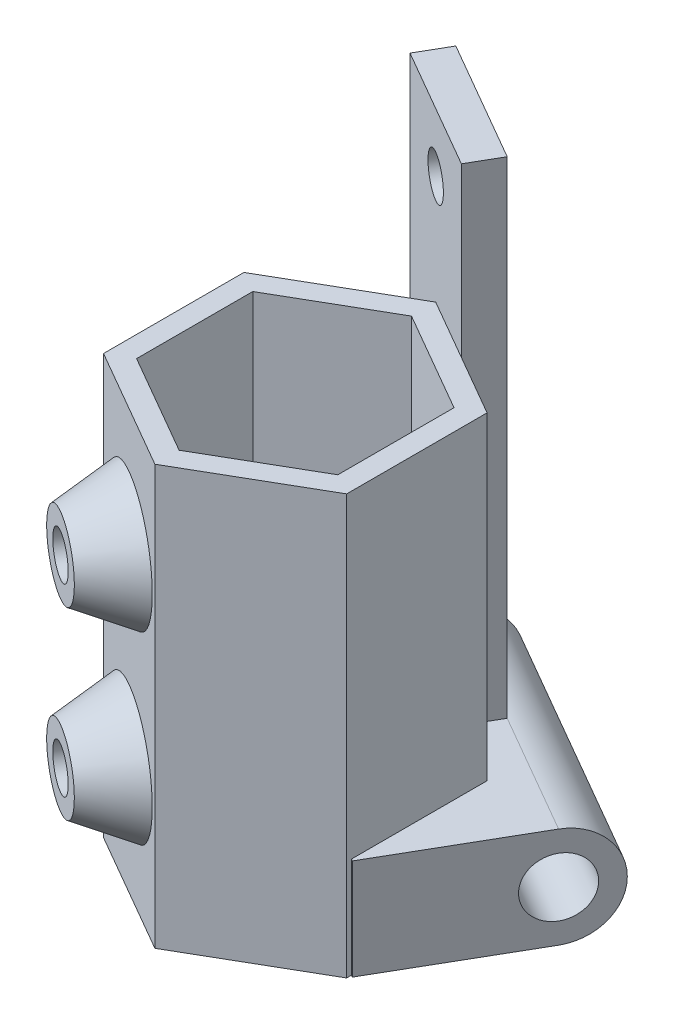
ISO-10303-21;
HEADER;
FILE_DESCRIPTION(('STEP AP214'),'2;1');
FILE_NAME('part.step','',(''),(''),'','','');
FILE_SCHEMA(('AUTOMOTIVE_DESIGN { 1 0 10303 214 1 1 1 1 }'));
ENDSEC;
DATA;
#1=APPLICATION_CONTEXT('core data for automotive mechanical design processes');
#2=APPLICATION_PROTOCOL_DEFINITION('international standard','automotive_design',2000,#1);
#3=PRODUCT_CONTEXT('',#1,'mechanical');
#4=PRODUCT('Part','Part','',(#3));
#5=PRODUCT_RELATED_PRODUCT_CATEGORY('part','',(#4));
#6=PRODUCT_DEFINITION_FORMATION('','',#4);
#7=PRODUCT_DEFINITION_CONTEXT('part definition',#1,'design');
#8=PRODUCT_DEFINITION('design','',#6,#7);
#9=PRODUCT_DEFINITION_SHAPE('','',#8);
#10=(LENGTH_UNIT() NAMED_UNIT(*) SI_UNIT(.MILLI.,.METRE.));
#11=(NAMED_UNIT(*) PLANE_ANGLE_UNIT() SI_UNIT($,.RADIAN.));
#12=(NAMED_UNIT(*) SI_UNIT($,.STERADIAN.) SOLID_ANGLE_UNIT());
#13=UNCERTAINTY_MEASURE_WITH_UNIT(LENGTH_MEASURE(1.E-05),#10,'distance_accuracy_value','');
#14=(GEOMETRIC_REPRESENTATION_CONTEXT(3) GLOBAL_UNCERTAINTY_ASSIGNED_CONTEXT((#13)) GLOBAL_UNIT_ASSIGNED_CONTEXT((#10,
#11,#12)) REPRESENTATION_CONTEXT('',''));
#15=CARTESIAN_POINT('',(0.,0.,0.));
#16=DIRECTION('',(0.,0.,1.));
#17=DIRECTION('',(1.,0.,0.));
#18=AXIS2_PLACEMENT_3D('',#15,#16,#17);
#19=CARTESIAN_POINT('',(7.25,25.,-4.18578945162479));
#20=DIRECTION('',(-0.5,0.,0.866025403784439));
#21=DIRECTION('',(0.866025403784439,0.,0.5));
#22=AXIS2_PLACEMENT_3D('',#19,#20,#21);
#23=PLANE('',#22);
#24=DIRECTION('',(0.,-1.,0.));
#25=VECTOR('',#24,1.);
#26=CARTESIAN_POINT('',(3.625,35.,-6.27868417743718));
#27=LINE('',#26,#25);
#28=CARTESIAN_POINT('',(3.62500000000001,25.,-6.27868417743718));
#29=VERTEX_POINT('',#28);
#30=CARTESIAN_POINT('',(3.625,6.,-6.27868417743718));
#31=VERTEX_POINT('',#30);
#32=EDGE_CURVE('E52',#29,#31,#27,.T.);
#33=ORIENTED_EDGE('',*,*,#32,.F.);
#34=DIRECTION('',(-0.866025403784439,0.,-0.5));
#35=VECTOR('',#34,1.);
#36=CARTESIAN_POINT('',(7.25,25.,-4.18578945162479));
#37=LINE('',#36,#35);
#38=CARTESIAN_POINT('',(7.25,25.,-4.18578945162479));
#39=VERTEX_POINT('',#38);
#40=EDGE_CURVE('E340',#39,#29,#37,.T.);
#41=ORIENTED_EDGE('',*,*,#40,.F.);
#42=DIRECTION('',(0.,-1.,0.));
#43=VECTOR('',#42,1.);
#44=CARTESIAN_POINT('',(7.25,25.,-4.18578945162479));
#45=LINE('',#44,#43);
#46=CARTESIAN_POINT('',(7.25,6.,-4.18578945162479));
#47=VERTEX_POINT('',#46);
#48=EDGE_CURVE('E373',#39,#47,#45,.T.);
#49=ORIENTED_EDGE('',*,*,#48,.T.);
#50=DIRECTION('',(-0.866025403784439,0.,-0.5));
#51=VECTOR('',#50,1.);
#52=CARTESIAN_POINT('',(7.25,6.,-4.18578945162479));
#53=LINE('',#52,#51);
#54=EDGE_CURVE('E314',#47,#31,#53,.T.);
#55=ORIENTED_EDGE('',*,*,#54,.T.);
#56=EDGE_LOOP('',(#33,#41,#49,#55));
#57=FACE_BOUND('',#56,.T.);
#58=ADVANCED_FACE('F35',(#57),#23,.F.);
#59=CARTESIAN_POINT('',(7.375,6.,3.96928310067868));
#60=DIRECTION('',(0.,1.,0.));
#61=DIRECTION('',(0.,0.,1.));
#62=AXIS2_PLACEMENT_3D('',#59,#60,#61);
#63=PLANE('',#62);
#64=DIRECTION('',(-0.866025403784439,0.,0.5));
#65=VECTOR('',#64,1.);
#66=CARTESIAN_POINT('',(0.,6.,-8.37157890324957));
#67=LINE('',#66,#65);
#68=CARTESIAN_POINT('',(0.,6.,-8.37157890324957));
#69=VERTEX_POINT('',#68);
#70=CARTESIAN_POINT('',(-7.,6.,-4.33012701892219));
#71=VERTEX_POINT('',#70);
#72=EDGE_CURVE('E376',#69,#71,#67,.T.);
#73=ORIENTED_EDGE('',*,*,#72,.F.);
#74=DIRECTION('',(0.866025403784439,0.,0.5));
#75=VECTOR('',#74,1.);
#76=CARTESIAN_POINT('',(3.625,6.,-6.27868417743718));
#77=LINE('',#76,#75);
#78=CARTESIAN_POINT('',(-3.625,6.,-10.464473629062));
#79=VERTEX_POINT('',#78);
#80=EDGE_CURVE('E422',#79,#69,#77,.T.);
#81=ORIENTED_EDGE('',*,*,#80,.F.);
#82=DIRECTION('',(0.5,0.,-0.866025403784439));
#83=VECTOR('',#82,1.);
#84=CARTESIAN_POINT('',(-7.125,6.,-4.4022958025709));
#85=LINE('',#84,#83);
#86=CARTESIAN_POINT('',(-7.125,6.,-4.4022958025709));
#87=VERTEX_POINT('',#86);
#88=EDGE_CURVE('E219',#87,#79,#85,.T.);
#89=ORIENTED_EDGE('',*,*,#88,.F.);
#90=DIRECTION('',(0.866025403784439,0.,0.5));
#91=VECTOR('',#90,1.);
#92=CARTESIAN_POINT('',(7.375,6.,3.96928310067868));
#93=LINE('',#92,#91);
#94=EDGE_CURVE('E295',#87,#71,#93,.T.);
#95=ORIENTED_EDGE('',*,*,#94,.T.);
#96=EDGE_LOOP('',(#73,#81,#89,#95));
#97=FACE_BOUND('',#96,.T.);
#98=ADVANCED_FACE('F421',(#97),#63,.T.);
#99=DIRECTION('',(0.866025403784439,0.,0.5));
#100=VECTOR('',#99,1.);
#101=CARTESIAN_POINT('',(11.875,6.,-3.82494553338127));
#102=LINE('',#101,#100);
#103=CARTESIAN_POINT('',(11.875,6.,-3.82494553338127));
#104=VERTEX_POINT('',#103);
#105=CARTESIAN_POINT('',(4.625,6.,-8.01073498500606));
#106=VERTEX_POINT('',#105);
#107=EDGE_CURVE('E11',#104,#106,#102,.F.);
#108=ORIENTED_EDGE('',*,*,#107,.T.);
#109=DIRECTION('',(0.500000000000001,0.,-0.866025403784438));
#110=VECTOR('',#109,1.);
#111=CARTESIAN_POINT('',(4.625,6.,-8.01073498500605));
#112=LINE('',#111,#110);
#113=EDGE_CURVE('E59',#31,#106,#112,.T.);
#114=ORIENTED_EDGE('',*,*,#113,.F.);
#115=ORIENTED_EDGE('',*,*,#54,.F.);
#116=DIRECTION('',(0.,0.,-1.));
#117=VECTOR('',#116,1.);
#118=CARTESIAN_POINT('',(7.25,6.,4.18578945162479));
#119=LINE('',#118,#117);
#120=CARTESIAN_POINT('',(7.25,6.,3.89711431702998));
#121=VERTEX_POINT('',#120);
#122=EDGE_CURVE('E316',#121,#47,#119,.T.);
#123=ORIENTED_EDGE('',*,*,#122,.F.);
#124=CARTESIAN_POINT('',(7.375,6.,3.96928310067868));
#125=VERTEX_POINT('',#124);
#126=EDGE_CURVE('E294',#121,#125,#93,.T.);
#127=ORIENTED_EDGE('',*,*,#126,.T.);
#128=DIRECTION('',(0.5,0.,-0.866025403784439));
#129=VECTOR('',#128,1.);
#130=CARTESIAN_POINT('',(7.375,6.,3.96928310067868));
#131=LINE('',#130,#129);
#132=EDGE_CURVE('E299',#125,#104,#131,.T.);
#133=ORIENTED_EDGE('',*,*,#132,.T.);
#134=EDGE_LOOP('',(#108,#114,#115,#123,#127,#133));
#135=FACE_BOUND('',#134,.T.);
#136=ADVANCED_FACE('F403',(#135),#63,.T.);
#137=CARTESIAN_POINT('',(7.25,25.,4.18578945162479));
#138=DIRECTION('',(-1.,0.,0.));
#139=DIRECTION('',(0.,0.,1.));
#140=AXIS2_PLACEMENT_3D('',#137,#138,#139);
#141=PLANE('',#140);
#142=DIRECTION('',(0.,-1.,0.));
#143=VECTOR('',#142,1.);
#144=CARTESIAN_POINT('',(7.25,25.,3.89711431702998));
#145=LINE('',#144,#143);
#146=CARTESIAN_POINT('',(7.25,0.,3.89711431702998));
#147=VERTEX_POINT('',#146);
#148=EDGE_CURVE('E311',#121,#147,#145,.T.);
#149=ORIENTED_EDGE('',*,*,#148,.F.);
#150=ORIENTED_EDGE('',*,*,#122,.T.);
#151=ORIENTED_EDGE('',*,*,#48,.F.);
#152=DIRECTION('',(0.,0.,-1.));
#153=VECTOR('',#152,1.);
#154=CARTESIAN_POINT('',(7.25,25.,4.18578945162479));
#155=LINE('',#154,#153);
#156=CARTESIAN_POINT('',(7.25,25.,4.18578945162479));
#157=VERTEX_POINT('',#156);
#158=EDGE_CURVE('E337',#157,#39,#155,.T.);
#159=ORIENTED_EDGE('',*,*,#158,.F.);
#160=DIRECTION('',(0.,-1.,0.));
#161=VECTOR('',#160,1.);
#162=CARTESIAN_POINT('',(7.25,25.,4.18578945162479));
#163=LINE('',#162,#161);
#164=CARTESIAN_POINT('',(7.25,0.,4.18578945162479));
#165=VERTEX_POINT('',#164);
#166=EDGE_CURVE('E351',#157,#165,#163,.T.);
#167=ORIENTED_EDGE('',*,*,#166,.T.);
#168=DIRECTION('',(0.,0.,-1.));
#169=VECTOR('',#168,1.);
#170=CARTESIAN_POINT('',(7.25,0.,4.18578945162479));
#171=LINE('',#170,#169);
#172=EDGE_CURVE('E336',#165,#147,#171,.T.);
#173=ORIENTED_EDGE('',*,*,#172,.T.);
#174=EDGE_LOOP('',(#149,#150,#151,#159,#167,#173));
#175=FACE_BOUND('',#174,.T.);
#176=ADVANCED_FACE('F467',(#175),#141,.F.);
#177=CARTESIAN_POINT('',(0.,25.,-8.37157890324957));
#178=DIRECTION('',(0.5,0.,0.866025403784439));
#179=DIRECTION('',(0.866025403784439,0.,-0.5));
#180=AXIS2_PLACEMENT_3D('',#177,#178,#179);
#181=PLANE('',#180);
#182=DIRECTION('',(0.,-1.,0.));
#183=VECTOR('',#182,1.);
#184=CARTESIAN_POINT('',(0.,25.,-8.37157890324957));
#185=LINE('',#184,#183);
#186=CARTESIAN_POINT('',(0.,25.,-8.37157890324957));
#187=VERTEX_POINT('',#186);
#188=EDGE_CURVE('E371',#187,#69,#185,.T.);
#189=ORIENTED_EDGE('',*,*,#188,.T.);
#190=ORIENTED_EDGE('',*,*,#72,.T.);
#191=DIRECTION('',(0.,1.,0.));
#192=VECTOR('',#191,1.);
#193=CARTESIAN_POINT('',(-7.00000000000001,25.,-4.33012701892219));
#194=LINE('',#193,#192);
#195=CARTESIAN_POINT('',(-7.,0.,-4.33012701892219));
#196=VERTEX_POINT('',#195);
#197=EDGE_CURVE('E302',#196,#71,#194,.T.);
#198=ORIENTED_EDGE('',*,*,#197,.F.);
#199=DIRECTION('',(-0.866025403784439,0.,0.5));
#200=VECTOR('',#199,1.);
#201=CARTESIAN_POINT('',(0.,0.,-8.37157890324957));
#202=LINE('',#201,#200);
#203=CARTESIAN_POINT('',(-7.25,0.,-4.18578945162479));
#204=VERTEX_POINT('',#203);
#205=EDGE_CURVE('E353',#196,#204,#202,.T.);
#206=ORIENTED_EDGE('',*,*,#205,.T.);
#207=DIRECTION('',(0.,-1.,0.));
#208=VECTOR('',#207,1.);
#209=CARTESIAN_POINT('',(-7.25,25.,-4.18578945162479));
#210=LINE('',#209,#208);
#211=CARTESIAN_POINT('',(-7.25,25.,-4.18578945162479));
#212=VERTEX_POINT('',#211);
#213=EDGE_CURVE('E368',#212,#204,#210,.T.);
#214=ORIENTED_EDGE('',*,*,#213,.F.);
#215=DIRECTION('',(-0.866025403784439,0.,0.5));
#216=VECTOR('',#215,1.);
#217=CARTESIAN_POINT('',(0.,25.,-8.37157890324957));
#218=LINE('',#217,#216);
#219=EDGE_CURVE('E343',#187,#212,#218,.T.);
#220=ORIENTED_EDGE('',*,*,#219,.F.);
#221=EDGE_LOOP('',(#189,#190,#198,#206,#214,#220));
#222=FACE_BOUND('',#221,.T.);
#223=ADVANCED_FACE('F465',(#222),#181,.F.);
#224=CARTESIAN_POINT('',(-7.25,25.,-4.18578945162479));
#225=DIRECTION('',(1.,0.,0.));
#226=DIRECTION('',(0.,0.,-1.));
#227=AXIS2_PLACEMENT_3D('',#224,#225,#226);
#228=PLANE('',#227);
#229=DIRECTION('',(0.,0.,1.));
#230=VECTOR('',#229,1.);
#231=CARTESIAN_POINT('',(-7.25,0.,-4.18578945162479));
#232=LINE('',#231,#230);
#233=CARTESIAN_POINT('',(-7.25,0.,4.18578945162479));
#234=VERTEX_POINT('',#233);
#235=EDGE_CURVE('E355',#204,#234,#232,.T.);
#236=ORIENTED_EDGE('',*,*,#235,.T.);
#237=DIRECTION('',(0.,-1.,0.));
#238=VECTOR('',#237,1.);
#239=CARTESIAN_POINT('',(-7.25,25.,4.18578945162479));
#240=LINE('',#239,#238);
#241=CARTESIAN_POINT('',(-7.25,25.,4.18578945162479));
#242=VERTEX_POINT('',#241);
#243=EDGE_CURVE('E365',#242,#234,#240,.T.);
#244=ORIENTED_EDGE('',*,*,#243,.F.);
#245=DIRECTION('',(0.,0.,1.));
#246=VECTOR('',#245,1.);
#247=CARTESIAN_POINT('',(-7.25,25.,-4.18578945162479));
#248=LINE('',#247,#246);
#249=EDGE_CURVE('E345',#212,#242,#248,.T.);
#250=ORIENTED_EDGE('',*,*,#249,.F.);
#251=ORIENTED_EDGE('',*,*,#213,.T.);
#252=EDGE_LOOP('',(#236,#244,#250,#251));
#253=FACE_BOUND('',#252,.T.);
#254=ADVANCED_FACE('F540',(#253),#228,.F.);
#255=CARTESIAN_POINT('',(-7.25,25.,4.18578945162479));
#256=DIRECTION('',(0.5,0.,-0.866025403784439));
#257=DIRECTION('',(-0.866025403784439,0.,-0.5));
#258=AXIS2_PLACEMENT_3D('',#255,#256,#257);
#259=PLANE('',#258);
#260=CARTESIAN_POINT('',(-3.625,7.,6.27868417743718));
#261=DIRECTION('',(-0.5,0.,0.866025403784439));
#262=DIRECTION('',(0.866025403784439,0.,0.5));
#263=AXIS2_PLACEMENT_3D('',#260,#261,#262);
#264=CIRCLE('',#263,3.75);
#265=CARTESIAN_POINT('',(-0.377404735808352,7.,8.15368417743718));
#266=VERTEX_POINT('',#265);
#267=EDGE_CURVE('E327',#266,#266,#264,.T.);
#268=ORIENTED_EDGE('',*,*,#267,.F.);
#269=EDGE_LOOP('',(#268));
#270=FACE_BOUND('',#269,.T.);
#271=CARTESIAN_POINT('',(-3.625,18.,6.27868417743718));
#272=DIRECTION('',(0.5,0.,-0.866025403784438));
#273=DIRECTION('',(-0.866025403784439,0.,-0.5));
#274=AXIS2_PLACEMENT_3D('',#271,#272,#273);
#275=CIRCLE('',#274,3.75);
#276=CARTESIAN_POINT('',(-6.87259526419165,18.,4.40368417743718));
#277=VERTEX_POINT('',#276);
#278=EDGE_CURVE('E333',#277,#277,#275,.T.);
#279=ORIENTED_EDGE('',*,*,#278,.T.);
#280=EDGE_LOOP('',(#279));
#281=FACE_BOUND('',#280,.T.);
#282=DIRECTION('',(0.866025403784439,0.,0.5));
#283=VECTOR('',#282,1.);
#284=CARTESIAN_POINT('',(-7.25,0.,4.18578945162479));
#285=LINE('',#284,#283);
#286=CARTESIAN_POINT('',(0.,0.,8.37157890324957));
#287=VERTEX_POINT('',#286);
#288=EDGE_CURVE('E357',#234,#287,#285,.T.);
#289=ORIENTED_EDGE('',*,*,#288,.T.);
#290=DIRECTION('',(0.,-1.,0.));
#291=VECTOR('',#290,1.);
#292=CARTESIAN_POINT('',(0.,25.,8.37157890324957));
#293=LINE('',#292,#291);
#294=CARTESIAN_POINT('',(0.,25.,8.37157890324957));
#295=VERTEX_POINT('',#294);
#296=EDGE_CURVE('E362',#295,#287,#293,.T.);
#297=ORIENTED_EDGE('',*,*,#296,.F.);
#298=DIRECTION('',(0.866025403784439,0.,0.5));
#299=VECTOR('',#298,1.);
#300=CARTESIAN_POINT('',(-7.25,25.,4.18578945162479));
#301=LINE('',#300,#299);
#302=EDGE_CURVE('E347',#242,#295,#301,.T.);
#303=ORIENTED_EDGE('',*,*,#302,.F.);
#304=ORIENTED_EDGE('',*,*,#243,.T.);
#305=EDGE_LOOP('',(#289,#297,#303,#304));
#306=FACE_BOUND('',#305,.T.);
#307=ADVANCED_FACE('F537',(#270,#281,#306),#259,.F.);
#308=CARTESIAN_POINT('',(0.,25.,8.37157890324957));
#309=DIRECTION('',(-0.5,0.,-0.866025403784439));
#310=DIRECTION('',(-0.866025403784439,0.,0.5));
#311=AXIS2_PLACEMENT_3D('',#308,#309,#310);
#312=PLANE('',#311);
#313=DIRECTION('',(0.866025403784439,0.,-0.5));
#314=VECTOR('',#313,1.);
#315=CARTESIAN_POINT('',(0.,0.,8.37157890324957));
#316=LINE('',#315,#314);
#317=EDGE_CURVE('E341',#287,#165,#316,.T.);
#318=ORIENTED_EDGE('',*,*,#317,.T.);
#319=ORIENTED_EDGE('',*,*,#166,.F.);
#320=DIRECTION('',(0.866025403784439,0.,-0.5));
#321=VECTOR('',#320,1.);
#322=CARTESIAN_POINT('',(0.,25.,8.37157890324957));
#323=LINE('',#322,#321);
#324=EDGE_CURVE('E349',#295,#157,#323,.T.);
#325=ORIENTED_EDGE('',*,*,#324,.F.);
#326=ORIENTED_EDGE('',*,*,#296,.T.);
#327=EDGE_LOOP('',(#318,#319,#325,#326));
#328=FACE_BOUND('',#327,.T.);
#329=ADVANCED_FACE('F530',(#328),#312,.F.);
#330=CARTESIAN_POINT('',(0.,25.,0.));
#331=DIRECTION('',(0.,1.,0.));
#332=DIRECTION('',(0.,0.,1.));
#333=AXIS2_PLACEMENT_3D('',#330,#331,#332);
#334=PLANE('',#333);
#335=DIRECTION('',(-0.866025403784438,0.,-0.5));
#336=VECTOR('',#335,1.);
#337=CARTESIAN_POINT('',(6.,25.,-3.46410161513776));
#338=LINE('',#337,#336);
#339=CARTESIAN_POINT('',(6.,25.,-3.46410161513776));
#340=VERTEX_POINT('',#339);
#341=CARTESIAN_POINT('',(0.,25.,-6.92820323027552));
#342=VERTEX_POINT('',#341);
#343=EDGE_CURVE('E253',#340,#342,#338,.T.);
#344=ORIENTED_EDGE('',*,*,#343,.F.);
#345=DIRECTION('',(0.,0.,-1.));
#346=VECTOR('',#345,1.);
#347=CARTESIAN_POINT('',(6.,25.,3.46410161513775));
#348=LINE('',#347,#346);
#349=CARTESIAN_POINT('',(6.,25.,3.46410161513775));
#350=VERTEX_POINT('',#349);
#351=EDGE_CURVE('E237',#350,#340,#348,.T.);
#352=ORIENTED_EDGE('',*,*,#351,.F.);
#353=DIRECTION('',(0.866025403784438,0.,-0.5));
#354=VECTOR('',#353,1.);
#355=CARTESIAN_POINT('',(0.,25.,6.92820323027551));
#356=LINE('',#355,#354);
#357=CARTESIAN_POINT('',(0.,25.,6.92820323027551));
#358=VERTEX_POINT('',#357);
#359=EDGE_CURVE('E264',#358,#350,#356,.T.);
#360=ORIENTED_EDGE('',*,*,#359,.F.);
#361=DIRECTION('',(0.866025403784439,0.,0.5));
#362=VECTOR('',#361,1.);
#363=CARTESIAN_POINT('',(-6.,25.,3.46410161513776));
#364=LINE('',#363,#362);
#365=CARTESIAN_POINT('',(-6.,25.,3.46410161513776));
#366=VERTEX_POINT('',#365);
#367=EDGE_CURVE('E261',#366,#358,#364,.T.);
#368=ORIENTED_EDGE('',*,*,#367,.F.);
#369=DIRECTION('',(0.,0.,1.));
#370=VECTOR('',#369,1.);
#371=CARTESIAN_POINT('',(-6.,25.,-3.46410161513776));
#372=LINE('',#371,#370);
#373=CARTESIAN_POINT('',(-6.,25.,-3.46410161513776));
#374=VERTEX_POINT('',#373);
#375=EDGE_CURVE('E258',#374,#366,#372,.T.);
#376=ORIENTED_EDGE('',*,*,#375,.F.);
#377=DIRECTION('',(-0.866025403784439,0.,0.5));
#378=VECTOR('',#377,1.);
#379=CARTESIAN_POINT('',(0.,25.,-6.92820323027551));
#380=LINE('',#379,#378);
#381=EDGE_CURVE('E255',#342,#374,#380,.T.);
#382=ORIENTED_EDGE('',*,*,#381,.F.);
#383=EDGE_LOOP('',(#344,#352,#360,#368,#376,#382));
#384=FACE_BOUND('',#383,.T.);
#385=ORIENTED_EDGE('',*,*,#158,.T.);
#386=ORIENTED_EDGE('',*,*,#40,.T.);
#387=DIRECTION('',(-0.866025403784439,0.,-0.5));
#388=VECTOR('',#387,1.);
#389=CARTESIAN_POINT('',(3.625,25.,-6.27868417743718));
#390=LINE('',#389,#388);
#391=EDGE_CURVE('E220',#29,#187,#390,.T.);
#392=ORIENTED_EDGE('',*,*,#391,.T.);
#393=ORIENTED_EDGE('',*,*,#219,.T.);
#394=ORIENTED_EDGE('',*,*,#249,.T.);
#395=ORIENTED_EDGE('',*,*,#302,.T.);
#396=ORIENTED_EDGE('',*,*,#324,.T.);
#397=EDGE_LOOP('',(#385,#386,#392,#393,#394,#395,#396));
#398=FACE_BOUND('',#397,.T.);
#399=ADVANCED_FACE('F527',(#384,#398),#334,.T.);
#400=CARTESIAN_POINT('',(0.,0.,0.));
#401=DIRECTION('',(0.,1.,0.));
#402=DIRECTION('',(0.,0.,1.));
#403=AXIS2_PLACEMENT_3D('',#400,#401,#402);
#404=PLANE('',#403);
#405=DIRECTION('',(0.,0.,-1.));
#406=VECTOR('',#405,1.);
#407=CARTESIAN_POINT('',(6.,0.,3.46410161513775));
#408=LINE('',#407,#406);
#409=CARTESIAN_POINT('',(6.,0.,3.46410161513775));
#410=VERTEX_POINT('',#409);
#411=CARTESIAN_POINT('',(6.,0.,-3.46410161513776));
#412=VERTEX_POINT('',#411);
#413=EDGE_CURVE('E249',#410,#412,#408,.T.);
#414=ORIENTED_EDGE('',*,*,#413,.T.);
#415=DIRECTION('',(-0.866025403784438,0.,-0.5));
#416=VECTOR('',#415,1.);
#417=CARTESIAN_POINT('',(6.,0.,-3.46410161513776));
#418=LINE('',#417,#416);
#419=CARTESIAN_POINT('',(0.,0.,-6.92820323027551));
#420=VERTEX_POINT('',#419);
#421=EDGE_CURVE('E233',#412,#420,#418,.T.);
#422=ORIENTED_EDGE('',*,*,#421,.T.);
#423=DIRECTION('',(-0.866025403784439,0.,0.5));
#424=VECTOR('',#423,1.);
#425=CARTESIAN_POINT('',(0.,0.,-6.92820323027551));
#426=LINE('',#425,#424);
#427=CARTESIAN_POINT('',(-6.,0.,-3.46410161513776));
#428=VERTEX_POINT('',#427);
#429=EDGE_CURVE('E236',#420,#428,#426,.T.);
#430=ORIENTED_EDGE('',*,*,#429,.T.);
#431=DIRECTION('',(0.,0.,1.));
#432=VECTOR('',#431,1.);
#433=CARTESIAN_POINT('',(-6.,0.,-3.46410161513776));
#434=LINE('',#433,#432);
#435=CARTESIAN_POINT('',(-6.,0.,3.46410161513776));
#436=VERTEX_POINT('',#435);
#437=EDGE_CURVE('E240',#428,#436,#434,.T.);
#438=ORIENTED_EDGE('',*,*,#437,.T.);
#439=DIRECTION('',(0.866025403784439,0.,0.5));
#440=VECTOR('',#439,1.);
#441=CARTESIAN_POINT('',(-6.,0.,3.46410161513776));
#442=LINE('',#441,#440);
#443=CARTESIAN_POINT('',(0.,0.,6.92820323027551));
#444=VERTEX_POINT('',#443);
#445=EDGE_CURVE('E243',#436,#444,#442,.T.);
#446=ORIENTED_EDGE('',*,*,#445,.T.);
#447=DIRECTION('',(0.866025403784438,0.,-0.5));
#448=VECTOR('',#447,1.);
#449=CARTESIAN_POINT('',(0.,0.,6.92820323027551));
#450=LINE('',#449,#448);
#451=EDGE_CURVE('E246',#444,#410,#450,.T.);
#452=ORIENTED_EDGE('',*,*,#451,.T.);
#453=EDGE_LOOP('',(#414,#422,#430,#438,#446,#452));
#454=FACE_BOUND('',#453,.T.);
#455=DIRECTION('',(0.5,0.,-0.866025403784439));
#456=VECTOR('',#455,1.);
#457=CARTESIAN_POINT('',(-7.125,0.,-4.4022958025709));
#458=LINE('',#457,#456);
#459=CARTESIAN_POINT('',(-7.125,0.,-4.4022958025709));
#460=VERTEX_POINT('',#459);
#461=CARTESIAN_POINT('',(-2.625,0.,-12.1965244366308));
#462=VERTEX_POINT('',#461);
#463=EDGE_CURVE('E304',#460,#462,#458,.T.);
#464=ORIENTED_EDGE('',*,*,#463,.T.);
#465=DIRECTION('',(-0.866025403784439,0.,-0.5));
#466=VECTOR('',#465,1.);
#467=CARTESIAN_POINT('',(11.875,0.,-3.82494553338127));
#468=LINE('',#467,#466);
#469=CARTESIAN_POINT('',(11.875,0.,-3.82494553338127));
#470=VERTEX_POINT('',#469);
#471=EDGE_CURVE('E384',#462,#470,#468,.F.);
#472=ORIENTED_EDGE('',*,*,#471,.T.);
#473=DIRECTION('',(0.5,0.,-0.866025403784439));
#474=VECTOR('',#473,1.);
#475=CARTESIAN_POINT('',(7.375,0.,3.96928310067868));
#476=LINE('',#475,#474);
#477=CARTESIAN_POINT('',(7.375,0.,3.96928310067868));
#478=VERTEX_POINT('',#477);
#479=EDGE_CURVE('E298',#478,#470,#476,.T.);
#480=ORIENTED_EDGE('',*,*,#479,.F.);
#481=DIRECTION('',(-0.866025403784439,0.,-0.5));
#482=VECTOR('',#481,1.);
#483=CARTESIAN_POINT('',(7.375,0.,3.96928310067868));
#484=LINE('',#483,#482);
#485=EDGE_CURVE('E289',#478,#147,#484,.T.);
#486=ORIENTED_EDGE('',*,*,#485,.T.);
#487=ORIENTED_EDGE('',*,*,#172,.F.);
#488=ORIENTED_EDGE('',*,*,#317,.F.);
#489=ORIENTED_EDGE('',*,*,#288,.F.);
#490=ORIENTED_EDGE('',*,*,#235,.F.);
#491=ORIENTED_EDGE('',*,*,#205,.F.);
#492=EDGE_CURVE('E288',#196,#460,#484,.T.);
#493=ORIENTED_EDGE('',*,*,#492,.T.);
#494=EDGE_LOOP('',(#464,#472,#480,#486,#487,#488,#489,#490,#491,#493));
#495=FACE_BOUND('',#494,.T.);
#496=ADVANCED_FACE('F410',(#454,#495),#404,.F.);
#497=CARTESIAN_POINT('',(-3.625,18.,6.27868417743718));
#498=DIRECTION('',(0.5,0.,-0.866025403784438));
#499=DIRECTION('',(-0.866025403784439,0.,-0.5));
#500=AXIS2_PLACEMENT_3D('',#497,#498,#499);
#501=CONICAL_SURFACE('',#500,3.75,0.463647609000806);
#502=CARTESIAN_POINT('',(-5.125,18.,8.8767603887905));
#503=DIRECTION('',(0.5,0.,-0.866025403784438));
#504=DIRECTION('',(-0.866025403784439,0.,-0.5));
#505=AXIS2_PLACEMENT_3D('',#502,#503,#504);
#506=CIRCLE('',#505,2.25);
#507=CARTESIAN_POINT('',(-7.07355715851499,18.,7.7517603887905));
#508=VERTEX_POINT('',#507);
#509=EDGE_CURVE('E330',#508,#508,#506,.T.);
#510=CARTESIAN_POINT('',(-7.07355715851499,18.,7.7517603887905));
#511=CARTESIAN_POINT('',(-7.07146380544912,18.,7.71688459492224));
#512=CARTESIAN_POINT('',(-7.06937045238325,18.,7.68200880105397));
#513=CARTESIAN_POINT('',(-7.06518374625152,18.,7.61225721331744));
#514=CARTESIAN_POINT('',(-7.06309039318565,18.,7.57738141944918));
#515=CARTESIAN_POINT('',(-7.05890368705391,18.,7.50762983171265));
#516=CARTESIAN_POINT('',(-7.05681033398804,18.,7.47275403784439));
#517=CARTESIAN_POINT('',(-7.05262362785631,18.,7.40300245010786));
#518=CARTESIAN_POINT('',(-7.05053027479044,18.,7.3681266562396));
#519=CARTESIAN_POINT('',(-7.0463435686587,18.,7.29837506850307));
#520=CARTESIAN_POINT('',(-7.04425021559283,18.,7.26349927463481));
#521=CARTESIAN_POINT('',(-7.0400635094611,18.,7.19374768689828));
#522=CARTESIAN_POINT('',(-7.03797015639523,18.,7.15887189303002));
#523=CARTESIAN_POINT('',(-7.03378345026349,18.,7.08912030529349));
#524=CARTESIAN_POINT('',(-7.03169009719762,18.,7.05424451142523));
#525=CARTESIAN_POINT('',(-7.02750339106589,18.,6.9844929236887));
#526=CARTESIAN_POINT('',(-7.02541003800002,18.,6.94961712982043));
#527=CARTESIAN_POINT('',(-7.02122333186828,18.,6.87986554208391));
#528=CARTESIAN_POINT('',(-7.01912997880241,18.,6.84498974821564));
#529=CARTESIAN_POINT('',(-7.01494327267068,18.,6.77523816047912));
#530=CARTESIAN_POINT('',(-7.01284991960481,18.,6.74036236661085));
#531=CARTESIAN_POINT('',(-7.00866321347307,18.,6.67061077887432));
#532=CARTESIAN_POINT('',(-7.00656986040721,18.,6.63573498500606));
#533=CARTESIAN_POINT('',(-7.00238315427547,18.,6.56598339726953));
#534=CARTESIAN_POINT('',(-7.0002898012096,18.,6.53110760340127));
#535=CARTESIAN_POINT('',(-6.99610309507787,18.,6.46135601566474));
#536=CARTESIAN_POINT('',(-6.994009742012,18.,6.42648022179648));
#537=CARTESIAN_POINT('',(-6.98982303588026,18.,6.35672863405995));
#538=CARTESIAN_POINT('',(-6.98772968281439,18.,6.32185284019169));
#539=CARTESIAN_POINT('',(-6.98354297668266,18.,6.25210125245516));
#540=CARTESIAN_POINT('',(-6.98144962361679,18.,6.2172254585869));
#541=CARTESIAN_POINT('',(-6.97726291748505,18.,6.14747387085037));
#542=CARTESIAN_POINT('',(-6.97516956441918,18.,6.11259807698211));
#543=CARTESIAN_POINT('',(-6.97098285828745,18.,6.04284648924558));
#544=CARTESIAN_POINT('',(-6.96888950522158,18.,6.00797069537731));
#545=CARTESIAN_POINT('',(-6.96470279908984,18.,5.93821910764079));
#546=CARTESIAN_POINT('',(-6.96260944602397,18.,5.90334331377252));
#547=CARTESIAN_POINT('',(-6.95842273989224,18.,5.833591726036));
#548=CARTESIAN_POINT('',(-6.95632938682637,18.,5.79871593216773));
#549=CARTESIAN_POINT('',(-6.95214268069464,18.,5.7289643444312));
#550=CARTESIAN_POINT('',(-6.95004932762877,18.,5.69408855056294));
#551=CARTESIAN_POINT('',(-6.94586262149703,18.,5.62433696282641));
#552=CARTESIAN_POINT('',(-6.94376926843116,18.,5.58946116895815));
#553=CARTESIAN_POINT('',(-6.93958256229943,18.,5.51970958122162));
#554=CARTESIAN_POINT('',(-6.93748920923356,18.,5.48483378735336));
#555=CARTESIAN_POINT('',(-6.93330250310182,18.,5.41508219961683));
#556=CARTESIAN_POINT('',(-6.93120915003595,18.,5.38020640574857));
#557=CARTESIAN_POINT('',(-6.92702244390422,18.,5.31045481801204));
#558=CARTESIAN_POINT('',(-6.92492909083835,18.,5.27557902414378));
#559=CARTESIAN_POINT('',(-6.92074238470661,18.,5.20582743640725));
#560=CARTESIAN_POINT('',(-6.91864903164074,18.,5.17095164253898));
#561=CARTESIAN_POINT('',(-6.91446232550901,18.,5.10120005480246));
#562=CARTESIAN_POINT('',(-6.91236897244314,18.,5.06632426093419));
#563=CARTESIAN_POINT('',(-6.9081822663114,18.,4.99657267319767));
#564=CARTESIAN_POINT('',(-6.90608891324553,18.,4.9616968793294));
#565=CARTESIAN_POINT('',(-6.9019022071138,18.,4.89194529159287));
#566=CARTESIAN_POINT('',(-6.89980885404793,18.,4.85706949772461));
#567=CARTESIAN_POINT('',(-6.89562214791619,18.,4.78731790998808));
#568=CARTESIAN_POINT('',(-6.89352879485033,18.,4.75244211611982));
#569=CARTESIAN_POINT('',(-6.88934208871859,18.,4.68269052838329));
#570=CARTESIAN_POINT('',(-6.88724873565272,18.,4.64781473451503));
#571=CARTESIAN_POINT('',(-6.88306202952099,18.,4.5780631467785));
#572=CARTESIAN_POINT('',(-6.88096867645512,18.,4.54318735291024));
#573=CARTESIAN_POINT('',(-6.87678197032338,18.,4.47343576517371));
#574=CARTESIAN_POINT('',(-6.87468861725751,18.,4.43855997130545));
#575=CARTESIAN_POINT('',(-6.87259526419165,18.,4.40368417743718));
#576=B_SPLINE_CURVE_WITH_KNOTS('',3,(#510,#511,#512,#513,#514,#515,#516,#517,#518,#519,#520,
#521,#522,#523,#524,#525,#526,#527,#528,#529,#530,#531,#532,#533,#534,#535,#536,#537,#538,#539,
#540,#541,#542,#543,#544,#545,#546,#547,#548,#549,#550,#551,#552,#553,#554,#555,#556,#557,#558,
#559,#560,#561,#562,#563,#564,#565,#566,#567,#568,#569,#570,#571,#572,#573,#574,#575),
.UNSPECIFIED.,.F.,.F.,(4,2,2,2,2,2,2,2,2,2,2,2,2,2,2,2,2,2,2,2,2,2,2,2,2,2,2,2,2,2,2,2,4),(0.,
0.104815686445304,0.209631372890606,0.314447059335909,0.41926274578121,0.524078432226514,
0.628894118671816,0.733709805117119,0.838525491562421,0.943341178007724,1.04815686445303,
1.15297255089833,1.25778823734363,1.36260392378894,1.46741961023424,1.57223529667954,
1.67705098312484,1.78186666957015,1.88668235601545,1.99149804246075,2.09631372890605,
2.20112941535136,2.30594510179666,2.41076078824196,2.51557647468726,2.62039216113257,
2.72520784757787,2.83002353402317,2.93483922046848,3.03965490691378,3.14447059335908,
3.24928627980439,3.35410196624969),.UNSPECIFIED.);
#577=EDGE_CURVE('BSEAM517',#508,#277,#576,.T.);
#578=ORIENTED_EDGE('',*,*,#509,.T.);
#579=ORIENTED_EDGE('',*,*,#278,.F.);
#580=ORIENTED_EDGE('',*,*,#577,.T.);
#581=ORIENTED_EDGE('',*,*,#577,.F.);
#582=EDGE_LOOP('',(#578,#580,#579,#581));
#583=FACE_BOUND('',#582,.T.);
#584=ADVANCED_FACE('F517',(#583),#501,.T.);
#585=CARTESIAN_POINT('',(-5.125,18.,8.8767603887905));
#586=DIRECTION('',(0.5,0.,-0.866025403784439));
#587=DIRECTION('',(-0.866025403784439,0.,-0.5));
#588=AXIS2_PLACEMENT_3D('',#585,#586,#587);
#589=PLANE('',#588);
#590=CARTESIAN_POINT('',(-5.125,18.,8.8767603887905));
#591=DIRECTION('',(-0.5,0.,0.866025403784439));
#592=DIRECTION('',(0.866025403784439,0.,0.5));
#593=AXIS2_PLACEMENT_3D('',#590,#591,#592);
#594=CIRCLE('',#593,1.25);
#595=CARTESIAN_POINT('',(-4.04246824526945,18.,9.5017603887905));
#596=VERTEX_POINT('',#595);
#597=EDGE_CURVE('E319',#596,#596,#594,.T.);
#598=ORIENTED_EDGE('',*,*,#597,.F.);
#599=EDGE_LOOP('',(#598));
#600=FACE_BOUND('',#599,.T.);
#601=ORIENTED_EDGE('',*,*,#509,.F.);
#602=EDGE_LOOP('',(#601));
#603=FACE_BOUND('',#602,.T.);
#604=ADVANCED_FACE('F515',(#600,#603),#589,.F.);
#605=CARTESIAN_POINT('',(-5.125,7.,8.8767603887905));
#606=DIRECTION('',(0.5,0.,-0.866025403784439));
#607=DIRECTION('',(-0.866025403784439,0.,-0.5));
#608=AXIS2_PLACEMENT_3D('',#605,#606,#607);
#609=CONICAL_SURFACE('',#608,2.25,0.463647609000805);
#610=ORIENTED_EDGE('',*,*,#267,.T.);
#611=EDGE_LOOP('',(#610));
#612=FACE_BOUND('',#611,.T.);
#613=CARTESIAN_POINT('',(-5.125,7.,8.8767603887905));
#614=DIRECTION('',(-0.5,0.,0.866025403784439));
#615=DIRECTION('',(0.866025403784439,0.,0.5));
#616=AXIS2_PLACEMENT_3D('',#613,#614,#615);
#617=CIRCLE('',#616,2.25);
#618=CARTESIAN_POINT('',(-3.17644284148501,7.,10.0017603887905));
#619=VERTEX_POINT('',#618);
#620=EDGE_CURVE('E322',#619,#619,#617,.T.);
#621=ORIENTED_EDGE('',*,*,#620,.F.);
#622=EDGE_LOOP('',(#621));
#623=FACE_BOUND('',#622,.T.);
#624=ADVANCED_FACE('F512',(#612,#623),#609,.T.);
#625=CARTESIAN_POINT('',(-5.125,7.,8.8767603887905));
#626=DIRECTION('',(-0.5,0.,0.866025403784439));
#627=DIRECTION('',(0.866025403784439,0.,0.5));
#628=AXIS2_PLACEMENT_3D('',#625,#626,#627);
#629=PLANE('',#628);
#630=CARTESIAN_POINT('',(-5.125,7.,8.8767603887905));
#631=DIRECTION('',(-0.5,0.,0.866025403784439));
#632=DIRECTION('',(-0.866025403784439,0.,-0.5));
#633=AXIS2_PLACEMENT_3D('',#630,#631,#632);
#634=CIRCLE('',#633,1.25);
#635=CARTESIAN_POINT('',(-6.20753175473055,7.,8.2517603887905));
#636=VERTEX_POINT('',#635);
#637=EDGE_CURVE('E318',#636,#636,#634,.T.);
#638=ORIENTED_EDGE('',*,*,#637,.F.);
#639=EDGE_LOOP('',(#638));
#640=FACE_BOUND('',#639,.T.);
#641=ORIENTED_EDGE('',*,*,#620,.T.);
#642=EDGE_LOOP('',(#641));
#643=FACE_BOUND('',#642,.T.);
#644=ADVANCED_FACE('F510',(#640,#643),#629,.T.);
#645=CARTESIAN_POINT('',(-0.125000000000002,7.,0.216506350946112));
#646=DIRECTION('',(-0.5,0.,0.866025403784439));
#647=DIRECTION('',(0.866025403784439,0.,0.5));
#648=AXIS2_PLACEMENT_3D('',#645,#646,#647);
#649=CYLINDRICAL_SURFACE('',#648,1.25);
#650=CARTESIAN_POINT('',(-3.,7.,5.19615242270664));
#651=DIRECTION('',(-0.5,0.,0.866025403784439));
#652=DIRECTION('',(0.866025403784439,0.,0.5));
#653=AXIS2_PLACEMENT_3D('',#650,#651,#652);
#654=CIRCLE('',#653,1.25);
#655=CARTESIAN_POINT('',(-1.91746824526945,7.,5.82115242270664));
#656=VERTEX_POINT('',#655);
#657=EDGE_CURVE('E282',#656,#656,#654,.F.);
#658=ORIENTED_EDGE('',*,*,#657,.T.);
#659=EDGE_LOOP('',(#658));
#660=FACE_BOUND('',#659,.T.);
#661=ORIENTED_EDGE('',*,*,#637,.T.);
#662=EDGE_LOOP('',(#661));
#663=FACE_BOUND('',#662,.T.);
#664=ADVANCED_FACE('F506',(#660,#663),#649,.F.);
#665=CARTESIAN_POINT('',(-0.125000000000002,18.,0.216506350946112));
#666=DIRECTION('',(-0.5,0.,0.866025403784439));
#667=DIRECTION('',(0.866025403784439,0.,0.5));
#668=AXIS2_PLACEMENT_3D('',#665,#666,#667);
#669=CYLINDRICAL_SURFACE('',#668,1.25);
#670=CARTESIAN_POINT('',(-3.,18.,5.19615242270664));
#671=DIRECTION('',(-0.5,0.,0.866025403784439));
#672=DIRECTION('',(0.866025403784439,0.,0.5));
#673=AXIS2_PLACEMENT_3D('',#670,#671,#672);
#674=CIRCLE('',#673,1.25);
#675=CARTESIAN_POINT('',(-1.91746824526945,18.,5.82115242270664));
#676=VERTEX_POINT('',#675);
#677=EDGE_CURVE('E271',#676,#676,#674,.F.);
#678=ORIENTED_EDGE('',*,*,#677,.T.);
#679=EDGE_LOOP('',(#678));
#680=FACE_BOUND('',#679,.T.);
#681=ORIENTED_EDGE('',*,*,#597,.T.);
#682=EDGE_LOOP('',(#681));
#683=FACE_BOUND('',#682,.T.);
#684=ADVANCED_FACE('F496',(#680,#683),#669,.F.);
#685=CARTESIAN_POINT('',(0.124999999999999,0.,-0.216506350946108));
#686=DIRECTION('',(0.5,0.,-0.866025403784439));
#687=DIRECTION('',(-0.866025403784439,0.,-0.5));
#688=AXIS2_PLACEMENT_3D('',#685,#686,#687);
#689=PLANE('',#688);
#690=ORIENTED_EDGE('',*,*,#126,.F.);
#691=ORIENTED_EDGE('',*,*,#148,.T.);
#692=ORIENTED_EDGE('',*,*,#485,.F.);
#693=DIRECTION('',(0.,-1.,0.));
#694=VECTOR('',#693,1.);
#695=CARTESIAN_POINT('',(7.375,6.,3.96928310067868));
#696=LINE('',#695,#694);
#697=EDGE_CURVE('E285',#125,#478,#696,.T.);
#698=ORIENTED_EDGE('',*,*,#697,.F.);
#699=EDGE_LOOP('',(#690,#691,#692,#698));
#700=FACE_BOUND('',#699,.T.);
#701=ADVANCED_FACE('F407',(#700),#689,.F.);
#702=ORIENTED_EDGE('',*,*,#492,.F.);
#703=ORIENTED_EDGE('',*,*,#197,.T.);
#704=ORIENTED_EDGE('',*,*,#94,.F.);
#705=DIRECTION('',(0.,1.,0.));
#706=VECTOR('',#705,1.);
#707=CARTESIAN_POINT('',(-7.125,6.,-4.4022958025709));
#708=LINE('',#707,#706);
#709=EDGE_CURVE('E292',#460,#87,#708,.T.);
#710=ORIENTED_EDGE('',*,*,#709,.F.);
#711=EDGE_LOOP('',(#702,#703,#704,#710));
#712=FACE_BOUND('',#711,.T.);
#713=ADVANCED_FACE('F418',(#712),#689,.F.);
#714=CARTESIAN_POINT('',(7.375,6.,3.96928310067868));
#715=DIRECTION('',(0.866025403784439,0.,0.5));
#716=DIRECTION('',(0.5,0.,-0.866025403784439));
#717=AXIS2_PLACEMENT_3D('',#714,#715,#716);
#718=PLANE('',#717);
#719=CARTESIAN_POINT('',(11.875,3.,-3.82494553338126));
#720=DIRECTION('',(0.866025403784439,0.,0.5));
#721=DIRECTION('',(0.5,0.,-0.866025403784439));
#722=AXIS2_PLACEMENT_3D('',#719,#720,#721);
#723=CIRCLE('',#722,1.75);
#724=CARTESIAN_POINT('',(12.75,3.,-5.34048999000403));
#725=VERTEX_POINT('',#724);
#726=EDGE_CURVE('E229',#725,#725,#723,.T.);
#727=ORIENTED_EDGE('',*,*,#726,.F.);
#728=EDGE_LOOP('',(#727));
#729=FACE_BOUND('',#728,.T.);
#730=ORIENTED_EDGE('',*,*,#479,.T.);
#731=CARTESIAN_POINT('',(11.875,3.,-3.82494553338127));
#732=DIRECTION('',(0.866025403784439,0.,0.5));
#733=DIRECTION('',(0.5,0.,-0.866025403784439));
#734=AXIS2_PLACEMENT_3D('',#731,#732,#733);
#735=CIRCLE('',#734,3.);
#736=CARTESIAN_POINT('',(13.375,3.,-6.42302174473458));
#737=VERTEX_POINT('',#736);
#738=EDGE_CURVE('E44',#470,#737,#735,.T.);
#739=ORIENTED_EDGE('',*,*,#738,.T.);
#740=CARTESIAN_POINT('',(11.875,3.,-3.82494553338127));
#741=DIRECTION('',(0.866025403784439,0.,0.5));
#742=DIRECTION('',(0.5,0.,-0.866025403784439));
#743=AXIS2_PLACEMENT_3D('',#740,#741,#742);
#744=CIRCLE('',#743,3.);
#745=EDGE_CURVE('E387',#737,#104,#744,.T.);
#746=ORIENTED_EDGE('',*,*,#745,.T.);
#747=ORIENTED_EDGE('',*,*,#132,.F.);
#748=ORIENTED_EDGE('',*,*,#697,.T.);
#749=EDGE_LOOP('',(#730,#739,#746,#747,#748));
#750=FACE_BOUND('',#749,.T.);
#751=ADVANCED_FACE('F401',(#729,#750),#718,.T.);
#752=CARTESIAN_POINT('',(-7.125,6.,-4.4022958025709));
#753=DIRECTION('',(-0.866025403784439,0.,-0.5));
#754=DIRECTION('',(-0.5,0.,0.866025403784439));
#755=AXIS2_PLACEMENT_3D('',#752,#753,#754);
#756=PLANE('',#755);
#757=CARTESIAN_POINT('',(-2.62500000000001,3.,-12.1965244366308));
#758=DIRECTION('',(-0.866025403784439,0.,-0.5));
#759=DIRECTION('',(-0.5,0.,0.866025403784439));
#760=AXIS2_PLACEMENT_3D('',#757,#758,#759);
#761=CIRCLE('',#760,1.75);
#762=CARTESIAN_POINT('',(-3.50000000000001,3.,-10.6809799800081));
#763=VERTEX_POINT('',#762);
#764=EDGE_CURVE('E222',#763,#763,#761,.T.);
#765=ORIENTED_EDGE('',*,*,#764,.F.);
#766=EDGE_LOOP('',(#765));
#767=FACE_BOUND('',#766,.T.);
#768=CARTESIAN_POINT('',(-2.62500000000001,3.,-12.1965244366308));
#769=DIRECTION('',(-0.866025403784439,0.,-0.5));
#770=DIRECTION('',(-0.5,0.,0.866025403784439));
#771=AXIS2_PLACEMENT_3D('',#768,#769,#770);
#772=CIRCLE('',#771,3.);
#773=CARTESIAN_POINT('',(-2.625,6.,-12.1965244366308));
#774=VERTEX_POINT('',#773);
#775=CARTESIAN_POINT('',(-1.12500000000001,3.,-14.7946006479842));
#776=VERTEX_POINT('',#775);
#777=EDGE_CURVE('E378',#774,#776,#772,.T.);
#778=ORIENTED_EDGE('',*,*,#777,.T.);
#779=CARTESIAN_POINT('',(-2.62500000000001,3.,-12.1965244366308));
#780=DIRECTION('',(-0.866025403784439,0.,-0.5));
#781=DIRECTION('',(-0.5,0.,0.866025403784439));
#782=AXIS2_PLACEMENT_3D('',#779,#780,#781);
#783=CIRCLE('',#782,3.);
#784=EDGE_CURVE('E382',#776,#462,#783,.T.);
#785=ORIENTED_EDGE('',*,*,#784,.T.);
#786=ORIENTED_EDGE('',*,*,#463,.F.);
#787=ORIENTED_EDGE('',*,*,#709,.T.);
#788=ORIENTED_EDGE('',*,*,#88,.T.);
#789=DIRECTION('',(0.,-1.,0.));
#790=VECTOR('',#789,1.);
#791=CARTESIAN_POINT('',(-3.625,35.,-10.464473629062));
#792=LINE('',#791,#790);
#793=CARTESIAN_POINT('',(-3.625,35.,-10.464473629062));
#794=VERTEX_POINT('',#793);
#795=EDGE_CURVE('E198',#794,#79,#792,.T.);
#796=ORIENTED_EDGE('',*,*,#795,.F.);
#797=DIRECTION('',(-0.5,0.,0.866025403784439));
#798=VECTOR('',#797,1.);
#799=CARTESIAN_POINT('',(-3.625,35.,-10.464473629062));
#800=LINE('',#799,#798);
#801=CARTESIAN_POINT('',(-2.625,35.,-12.1965244366308));
#802=VERTEX_POINT('',#801);
#803=EDGE_CURVE('E205',#802,#794,#800,.T.);
#804=ORIENTED_EDGE('',*,*,#803,.F.);
#805=DIRECTION('',(0.,-1.,0.));
#806=VECTOR('',#805,1.);
#807=CARTESIAN_POINT('',(-2.625,35.,-12.1965244366308));
#808=LINE('',#807,#806);
#809=EDGE_CURVE('E432',#802,#774,#808,.T.);
#810=ORIENTED_EDGE('',*,*,#809,.T.);
#811=EDGE_LOOP('',(#778,#785,#786,#787,#788,#796,#804,#810));
#812=FACE_BOUND('',#811,.T.);
#813=ADVANCED_FACE('F217',(#767,#812),#756,.T.);
#814=CARTESIAN_POINT('',(-6.,0.,3.46410161513776));
#815=DIRECTION('',(-0.5,0.,0.866025403784439));
#816=DIRECTION('',(0.866025403784439,0.,0.5));
#817=AXIS2_PLACEMENT_3D('',#814,#815,#816);
#818=PLANE('',#817);
#819=ORIENTED_EDGE('',*,*,#677,.F.);
#820=EDGE_LOOP('',(#819));
#821=FACE_BOUND('',#820,.T.);
#822=ORIENTED_EDGE('',*,*,#367,.T.);
#823=DIRECTION('',(0.,1.,0.));
#824=VECTOR('',#823,1.);
#825=CARTESIAN_POINT('',(0.,0.,6.92820323027551));
#826=LINE('',#825,#824);
#827=EDGE_CURVE('E274',#444,#358,#826,.T.);
#828=ORIENTED_EDGE('',*,*,#827,.F.);
#829=ORIENTED_EDGE('',*,*,#445,.F.);
#830=DIRECTION('',(0.,1.,0.));
#831=VECTOR('',#830,1.);
#832=CARTESIAN_POINT('',(-6.,0.,3.46410161513776));
#833=LINE('',#832,#831);
#834=EDGE_CURVE('E276',#436,#366,#833,.T.);
#835=ORIENTED_EDGE('',*,*,#834,.T.);
#836=EDGE_LOOP('',(#822,#828,#829,#835));
#837=FACE_BOUND('',#836,.T.);
#838=ORIENTED_EDGE('',*,*,#657,.F.);
#839=EDGE_LOOP('',(#838));
#840=FACE_BOUND('',#839,.T.);
#841=ADVANCED_FACE('F493',(#821,#837,#840),#818,.F.);
#842=CARTESIAN_POINT('',(6.,0.,-3.46410161513776));
#843=DIRECTION('',(0.5,0.,-0.866025403784438));
#844=DIRECTION('',(-0.866025403784439,0.,-0.5));
#845=AXIS2_PLACEMENT_3D('',#842,#843,#844);
#846=PLANE('',#845);
#847=ORIENTED_EDGE('',*,*,#343,.T.);
#848=DIRECTION('',(0.,1.,0.));
#849=VECTOR('',#848,1.);
#850=CARTESIAN_POINT('',(0.,0.,-6.92820323027551));
#851=LINE('',#850,#849);
#852=EDGE_CURVE('E252',#420,#342,#851,.T.);
#853=ORIENTED_EDGE('',*,*,#852,.F.);
#854=ORIENTED_EDGE('',*,*,#421,.F.);
#855=DIRECTION('',(0.,1.,0.));
#856=VECTOR('',#855,1.);
#857=CARTESIAN_POINT('',(6.,0.,-3.46410161513776));
#858=LINE('',#857,#856);
#859=EDGE_CURVE('E269',#412,#340,#858,.T.);
#860=ORIENTED_EDGE('',*,*,#859,.T.);
#861=EDGE_LOOP('',(#847,#853,#854,#860));
#862=FACE_BOUND('',#861,.T.);
#863=ADVANCED_FACE('F489',(#862),#846,.F.);
#864=CARTESIAN_POINT('',(6.,0.,3.46410161513775));
#865=DIRECTION('',(1.,0.,0.));
#866=DIRECTION('',(0.,0.,-1.));
#867=AXIS2_PLACEMENT_3D('',#864,#865,#866);
#868=PLANE('',#867);
#869=ORIENTED_EDGE('',*,*,#351,.T.);
#870=ORIENTED_EDGE('',*,*,#859,.F.);
#871=ORIENTED_EDGE('',*,*,#413,.F.);
#872=DIRECTION('',(0.,1.,0.));
#873=VECTOR('',#872,1.);
#874=CARTESIAN_POINT('',(6.,0.,3.46410161513775));
#875=LINE('',#874,#873);
#876=EDGE_CURVE('E272',#410,#350,#875,.T.);
#877=ORIENTED_EDGE('',*,*,#876,.T.);
#878=EDGE_LOOP('',(#869,#870,#871,#877));
#879=FACE_BOUND('',#878,.T.);
#880=ADVANCED_FACE('F492',(#879),#868,.F.);
#881=CARTESIAN_POINT('',(0.,0.,6.92820323027551));
#882=DIRECTION('',(0.5,0.,0.866025403784438));
#883=DIRECTION('',(0.866025403784439,0.,-0.5));
#884=AXIS2_PLACEMENT_3D('',#881,#882,#883);
#885=PLANE('',#884);
#886=ORIENTED_EDGE('',*,*,#359,.T.);
#887=ORIENTED_EDGE('',*,*,#876,.F.);
#888=ORIENTED_EDGE('',*,*,#451,.F.);
#889=ORIENTED_EDGE('',*,*,#827,.T.);
#890=EDGE_LOOP('',(#886,#887,#888,#889));
#891=FACE_BOUND('',#890,.T.);
#892=ADVANCED_FACE('F484',(#891),#885,.F.);
#893=CARTESIAN_POINT('',(-6.,0.,-3.46410161513776));
#894=DIRECTION('',(-1.,0.,0.));
#895=DIRECTION('',(0.,0.,1.));
#896=AXIS2_PLACEMENT_3D('',#893,#894,#895);
#897=PLANE('',#896);
#898=ORIENTED_EDGE('',*,*,#375,.T.);
#899=ORIENTED_EDGE('',*,*,#834,.F.);
#900=ORIENTED_EDGE('',*,*,#437,.F.);
#901=DIRECTION('',(0.,1.,0.));
#902=VECTOR('',#901,1.);
#903=CARTESIAN_POINT('',(-6.,0.,-3.46410161513776));
#904=LINE('',#903,#902);
#905=EDGE_CURVE('E278',#428,#374,#904,.T.);
#906=ORIENTED_EDGE('',*,*,#905,.T.);
#907=EDGE_LOOP('',(#898,#899,#900,#906));
#908=FACE_BOUND('',#907,.T.);
#909=ADVANCED_FACE('F478',(#908),#897,.F.);
#910=CARTESIAN_POINT('',(0.,0.,-6.92820323027551));
#911=DIRECTION('',(-0.5,0.,-0.866025403784439));
#912=DIRECTION('',(-0.866025403784439,0.,0.5));
#913=AXIS2_PLACEMENT_3D('',#910,#911,#912);
#914=PLANE('',#913);
#915=ORIENTED_EDGE('',*,*,#381,.T.);
#916=ORIENTED_EDGE('',*,*,#905,.F.);
#917=ORIENTED_EDGE('',*,*,#429,.F.);
#918=ORIENTED_EDGE('',*,*,#852,.T.);
#919=EDGE_LOOP('',(#915,#916,#917,#918));
#920=FACE_BOUND('',#919,.T.);
#921=ADVANCED_FACE('F474',(#920),#914,.F.);
#922=CARTESIAN_POINT('',(4.625,3.,-8.01073498500606));
#923=DIRECTION('',(0.866025403784439,0.,0.5));
#924=DIRECTION('',(0.5,0.,-0.866025403784439));
#925=AXIS2_PLACEMENT_3D('',#922,#923,#924);
#926=CYLINDRICAL_SURFACE('',#925,3.);
#927=ORIENTED_EDGE('',*,*,#107,.F.);
#928=ORIENTED_EDGE('',*,*,#745,.F.);
#929=DIRECTION('',(0.866025403784439,0.,0.5));
#930=VECTOR('',#929,1.);
#931=CARTESIAN_POINT('',(6.125,3.,-10.6088111963594));
#932=LINE('',#931,#930);
#933=EDGE_CURVE('E232',#776,#737,#932,.T.);
#934=ORIENTED_EDGE('',*,*,#933,.F.);
#935=ORIENTED_EDGE('',*,*,#777,.F.);
#936=DIRECTION('',(-0.866025403784439,0.,-0.5));
#937=VECTOR('',#936,1.);
#938=CARTESIAN_POINT('',(-2.625,6.,-12.1965244366308));
#939=LINE('',#938,#937);
#940=EDGE_CURVE('E214',#106,#774,#939,.T.);
#941=ORIENTED_EDGE('',*,*,#940,.F.);
#942=EDGE_LOOP('',(#927,#928,#934,#935,#941));
#943=FACE_BOUND('',#942,.T.);
#944=ADVANCED_FACE('F37',(#943),#926,.T.);
#945=CARTESIAN_POINT('',(4.625,3.,-8.01073498500606));
#946=DIRECTION('',(0.866025403784439,0.,0.5));
#947=DIRECTION('',(0.5,0.,-0.866025403784439));
#948=AXIS2_PLACEMENT_3D('',#945,#946,#947);
#949=CYLINDRICAL_SURFACE('',#948,3.);
#950=ORIENTED_EDGE('',*,*,#738,.F.);
#951=ORIENTED_EDGE('',*,*,#471,.F.);
#952=ORIENTED_EDGE('',*,*,#784,.F.);
#953=ORIENTED_EDGE('',*,*,#933,.T.);
#954=EDGE_LOOP('',(#950,#951,#952,#953));
#955=FACE_BOUND('',#954,.T.);
#956=ADVANCED_FACE('F393',(#955),#949,.T.);
#957=CARTESIAN_POINT('',(18.9871392896287,3.,0.281250000000011));
#958=DIRECTION('',(-0.866025403784439,0.,-0.5));
#959=DIRECTION('',(-0.5,0.,0.866025403784438));
#960=AXIS2_PLACEMENT_3D('',#957,#958,#959);
#961=CYLINDRICAL_SURFACE('',#960,1.75);
#962=ORIENTED_EDGE('',*,*,#726,.T.);
#963=EDGE_LOOP('',(#962));
#964=FACE_BOUND('',#963,.T.);
#965=ORIENTED_EDGE('',*,*,#764,.T.);
#966=EDGE_LOOP('',(#965));
#967=FACE_BOUND('',#966,.T.);
#968=ADVANCED_FACE('F447',(#964,#967),#961,.F.);
#969=CARTESIAN_POINT('',(3.625,35.,-6.27868417743718));
#970=DIRECTION('',(0.5,0.,-0.866025403784439));
#971=DIRECTION('',(-0.866025403784439,0.,-0.5));
#972=AXIS2_PLACEMENT_3D('',#969,#970,#971);
#973=PLANE('',#972);
#974=CARTESIAN_POINT('',(0.,31.5,-8.37157890324957));
#975=DIRECTION('',(-0.5,0.,0.866025403784439));
#976=DIRECTION('',(0.866025403784439,0.,0.5));
#977=AXIS2_PLACEMENT_3D('',#974,#975,#976);
#978=CIRCLE('',#977,1.25);
#979=CARTESIAN_POINT('',(1.08253175473055,31.5,-7.74657890324957));
#980=VERTEX_POINT('',#979);
#981=EDGE_CURVE('E427',#980,#980,#978,.T.);
#982=ORIENTED_EDGE('',*,*,#981,.F.);
#983=EDGE_LOOP('',(#982));
#984=FACE_BOUND('',#983,.T.);
#985=ORIENTED_EDGE('',*,*,#80,.T.);
#986=ORIENTED_EDGE('',*,*,#188,.F.);
#987=ORIENTED_EDGE('',*,*,#391,.F.);
#988=CARTESIAN_POINT('',(3.625,35.,-6.27868417743718));
#989=VERTEX_POINT('',#988);
#990=EDGE_CURVE('E201',#989,#29,#27,.T.);
#991=ORIENTED_EDGE('',*,*,#990,.F.);
#992=DIRECTION('',(0.866025403784439,0.,0.5));
#993=VECTOR('',#992,1.);
#994=CARTESIAN_POINT('',(3.625,35.,-6.27868417743718));
#995=LINE('',#994,#993);
#996=EDGE_CURVE('E193',#794,#989,#995,.T.);
#997=ORIENTED_EDGE('',*,*,#996,.F.);
#998=ORIENTED_EDGE('',*,*,#795,.T.);
#999=EDGE_LOOP('',(#985,#986,#987,#991,#997,#998));
#1000=FACE_BOUND('',#999,.T.);
#1001=ADVANCED_FACE('F196',(#984,#1000),#973,.F.);
#1002=CARTESIAN_POINT('',(4.625,35.,-8.01073498500605));
#1003=DIRECTION('',(-0.866025403784438,0.,-0.500000000000001));
#1004=DIRECTION('',(-0.500000000000001,0.,0.866025403784438));
#1005=AXIS2_PLACEMENT_3D('',#1002,#1003,#1004);
#1006=PLANE('',#1005);
#1007=ORIENTED_EDGE('',*,*,#113,.T.);
#1008=DIRECTION('',(0.,-1.,0.));
#1009=VECTOR('',#1008,1.);
#1010=CARTESIAN_POINT('',(4.625,35.,-8.01073498500605));
#1011=LINE('',#1010,#1009);
#1012=CARTESIAN_POINT('',(4.625,35.,-8.01073498500605));
#1013=VERTEX_POINT('',#1012);
#1014=EDGE_CURVE('E433',#1013,#106,#1011,.T.);
#1015=ORIENTED_EDGE('',*,*,#1014,.F.);
#1016=DIRECTION('',(0.500000000000001,0.,-0.866025403784438));
#1017=VECTOR('',#1016,1.);
#1018=CARTESIAN_POINT('',(4.625,35.,-8.01073498500605));
#1019=LINE('',#1018,#1017);
#1020=EDGE_CURVE('E204',#989,#1013,#1019,.T.);
#1021=ORIENTED_EDGE('',*,*,#1020,.F.);
#1022=ORIENTED_EDGE('',*,*,#990,.T.);
#1023=ORIENTED_EDGE('',*,*,#32,.T.);
#1024=EDGE_LOOP('',(#1007,#1015,#1021,#1022,#1023));
#1025=FACE_BOUND('',#1024,.T.);
#1026=ADVANCED_FACE('F438',(#1025),#1006,.F.);
#1027=CARTESIAN_POINT('',(-2.625,35.,-12.1965244366308));
#1028=DIRECTION('',(-0.5,0.,0.866025403784439));
#1029=DIRECTION('',(0.866025403784439,0.,0.5));
#1030=AXIS2_PLACEMENT_3D('',#1027,#1028,#1029);
#1031=PLANE('',#1030);
#1032=CARTESIAN_POINT('',(0.999999999999997,31.5,-10.1036297108184));
#1033=DIRECTION('',(-0.5,0.,0.866025403784439));
#1034=DIRECTION('',(0.866025403784439,0.,0.5));
#1035=AXIS2_PLACEMENT_3D('',#1032,#1033,#1034);
#1036=CIRCLE('',#1035,1.25);
#1037=CARTESIAN_POINT('',(2.08253175473055,31.5,-9.47862971081845));
#1038=VERTEX_POINT('',#1037);
#1039=EDGE_CURVE('E39',#1038,#1038,#1036,.T.);
#1040=ORIENTED_EDGE('',*,*,#1039,.T.);
#1041=EDGE_LOOP('',(#1040));
#1042=FACE_BOUND('',#1041,.T.);
#1043=ORIENTED_EDGE('',*,*,#940,.T.);
#1044=ORIENTED_EDGE('',*,*,#809,.F.);
#1045=DIRECTION('',(-0.866025403784439,0.,-0.5));
#1046=VECTOR('',#1045,1.);
#1047=CARTESIAN_POINT('',(-2.625,35.,-12.1965244366308));
#1048=LINE('',#1047,#1046);
#1049=EDGE_CURVE('E210',#1013,#802,#1048,.T.);
#1050=ORIENTED_EDGE('',*,*,#1049,.F.);
#1051=ORIENTED_EDGE('',*,*,#1014,.T.);
#1052=EDGE_LOOP('',(#1043,#1044,#1050,#1051));
#1053=FACE_BOUND('',#1052,.T.);
#1054=ADVANCED_FACE('F453',(#1042,#1053),#1031,.F.);
#1055=CARTESIAN_POINT('',(0.,35.,0.));
#1056=DIRECTION('',(0.,-1.,0.));
#1057=DIRECTION('',(0.,0.,-1.));
#1058=AXIS2_PLACEMENT_3D('',#1055,#1056,#1057);
#1059=PLANE('',#1058);
#1060=ORIENTED_EDGE('',*,*,#803,.T.);
#1061=ORIENTED_EDGE('',*,*,#996,.T.);
#1062=ORIENTED_EDGE('',*,*,#1020,.T.);
#1063=ORIENTED_EDGE('',*,*,#1049,.T.);
#1064=EDGE_LOOP('',(#1060,#1061,#1062,#1063));
#1065=FACE_BOUND('',#1064,.T.);
#1066=ADVANCED_FACE('F208',(#1065),#1059,.F.);
#1067=CARTESIAN_POINT('',(6.125,31.5,-18.980390099609));
#1068=DIRECTION('',(-0.5,0.,0.866025403784439));
#1069=DIRECTION('',(0.866025403784439,0.,0.5));
#1070=AXIS2_PLACEMENT_3D('',#1067,#1068,#1069);
#1071=CYLINDRICAL_SURFACE('',#1070,1.25);
#1072=ORIENTED_EDGE('',*,*,#981,.T.);
#1073=EDGE_LOOP('',(#1072));
#1074=FACE_BOUND('',#1073,.T.);
#1075=ORIENTED_EDGE('',*,*,#1039,.F.);
#1076=EDGE_LOOP('',(#1075));
#1077=FACE_BOUND('',#1076,.T.);
#1078=ADVANCED_FACE('F443',(#1074,#1077),#1071,.F.);
#1079=CLOSED_SHELL('',(#58,#98,#136,#176,#223,#254,#307,#329,#399,#496,#584,#604,#624,#644,#664,
#684,#701,#713,#751,#813,#841,#863,#880,#892,#909,#921,#944,#956,#968,#1001,#1026,#1054,#1066,#1078));
#1080=MANIFOLD_SOLID_BREP('B2',#1079);
#1081=ADVANCED_BREP_SHAPE_REPRESENTATION('',(#18,#1080),#14);
#1082=SHAPE_DEFINITION_REPRESENTATION(#9,#1081);
ENDSEC;
END-ISO-10303-21;
